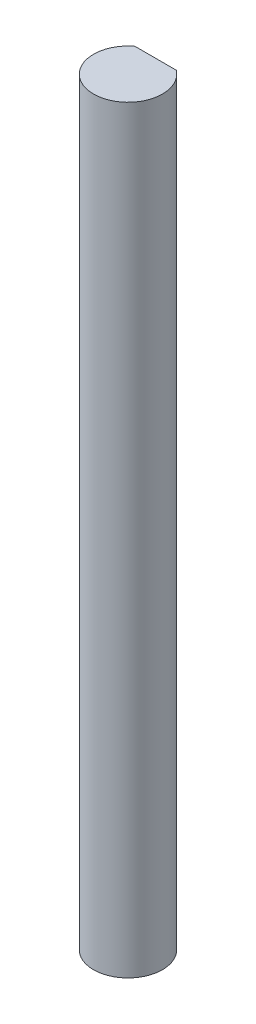
ISO-10303-21;
HEADER;
FILE_DESCRIPTION(('STEP AP214'),'2;1');
FILE_NAME('part.step','',(''),(''),'','','');
FILE_SCHEMA(('AUTOMOTIVE_DESIGN { 1 0 10303 214 1 1 1 1 }'));
ENDSEC;
DATA;
#1=APPLICATION_CONTEXT('core data for automotive mechanical design processes');
#2=APPLICATION_PROTOCOL_DEFINITION('international standard','automotive_design',2000,#1);
#3=PRODUCT_CONTEXT('',#1,'mechanical');
#4=PRODUCT('Part','Part','',(#3));
#5=PRODUCT_RELATED_PRODUCT_CATEGORY('part','',(#4));
#6=PRODUCT_DEFINITION_FORMATION('','',#4);
#7=PRODUCT_DEFINITION_CONTEXT('part definition',#1,'design');
#8=PRODUCT_DEFINITION('design','',#6,#7);
#9=PRODUCT_DEFINITION_SHAPE('','',#8);
#10=(LENGTH_UNIT() NAMED_UNIT(*) SI_UNIT(.MILLI.,.METRE.));
#11=(NAMED_UNIT(*) PLANE_ANGLE_UNIT() SI_UNIT($,.RADIAN.));
#12=(NAMED_UNIT(*) SI_UNIT($,.STERADIAN.) SOLID_ANGLE_UNIT());
#13=UNCERTAINTY_MEASURE_WITH_UNIT(LENGTH_MEASURE(1.E-05),#10,'distance_accuracy_value','');
#14=(GEOMETRIC_REPRESENTATION_CONTEXT(3) GLOBAL_UNCERTAINTY_ASSIGNED_CONTEXT((#13)) GLOBAL_UNIT_ASSIGNED_CONTEXT((#10,
#11,#12)) REPRESENTATION_CONTEXT('',''));
#15=CARTESIAN_POINT('',(0.,0.,0.));
#16=DIRECTION('',(0.,0.,1.));
#17=DIRECTION('',(1.,0.,0.));
#18=AXIS2_PLACEMENT_3D('',#15,#16,#17);
#19=CARTESIAN_POINT('',(0.,69.85,0.));
#20=DIRECTION('',(0.,-1.,0.));
#21=DIRECTION('',(0.,0.,-1.));
#22=AXIS2_PLACEMENT_3D('',#19,#20,#21);
#23=CYLINDRICAL_SURFACE('',#22,3.175);
#24=CARTESIAN_POINT('',(0.,0.,0.));
#25=DIRECTION('',(0.,1.,0.));
#26=DIRECTION('',(0.,0.,1.));
#27=AXIS2_PLACEMENT_3D('',#24,#25,#26);
#28=CIRCLE('',#27,3.175);
#29=CARTESIAN_POINT('',(-1.905,0.,-2.54));
#30=VERTEX_POINT('',#29);
#31=CARTESIAN_POINT('',(1.905,0.,-2.54));
#32=VERTEX_POINT('',#31);
#33=EDGE_CURVE('E64',#30,#32,#28,.T.);
#34=ORIENTED_EDGE('',*,*,#33,.T.);
#35=DIRECTION('',(0.,-1.,0.));
#36=VECTOR('',#35,1.);
#37=CARTESIAN_POINT('',(1.905,69.85,-2.54));
#38=LINE('',#37,#36);
#39=CARTESIAN_POINT('',(1.905,69.85,-2.54));
#40=VERTEX_POINT('',#39);
#41=EDGE_CURVE('E11',#40,#32,#38,.T.);
#42=ORIENTED_EDGE('',*,*,#41,.F.);
#43=CARTESIAN_POINT('',(0.,69.85,0.));
#44=DIRECTION('',(0.,1.,0.));
#45=DIRECTION('',(0.,0.,1.));
#46=AXIS2_PLACEMENT_3D('',#43,#44,#45);
#47=CIRCLE('',#46,3.175);
#48=CARTESIAN_POINT('',(-1.905,69.85,-2.54));
#49=VERTEX_POINT('',#48);
#50=EDGE_CURVE('E63',#49,#40,#47,.T.);
#51=ORIENTED_EDGE('',*,*,#50,.F.);
#52=DIRECTION('',(0.,-1.,0.));
#53=VECTOR('',#52,1.);
#54=CARTESIAN_POINT('',(-1.905,69.85,-2.54));
#55=LINE('',#54,#53);
#56=EDGE_CURVE('E41',#49,#30,#55,.T.);
#57=ORIENTED_EDGE('',*,*,#56,.T.);
#58=EDGE_LOOP('',(#34,#42,#51,#57));
#59=FACE_BOUND('',#58,.T.);
#60=ADVANCED_FACE('F33',(#59),#23,.T.);
#61=CARTESIAN_POINT('',(-1.905,69.85,-2.54));
#62=DIRECTION('',(0.,0.,1.));
#63=DIRECTION('',(1.,0.,0.));
#64=AXIS2_PLACEMENT_3D('',#61,#62,#63);
#65=PLANE('',#64);
#66=DIRECTION('',(-1.,0.,0.));
#67=VECTOR('',#66,1.);
#68=CARTESIAN_POINT('',(-1.905,0.,-2.54));
#69=LINE('',#68,#67);
#70=EDGE_CURVE('E56',#32,#30,#69,.T.);
#71=ORIENTED_EDGE('',*,*,#70,.T.);
#72=ORIENTED_EDGE('',*,*,#56,.F.);
#73=DIRECTION('',(-1.,0.,0.));
#74=VECTOR('',#73,1.);
#75=CARTESIAN_POINT('',(-1.905,69.85,-2.54));
#76=LINE('',#75,#74);
#77=EDGE_CURVE('E48',#40,#49,#76,.T.);
#78=ORIENTED_EDGE('',*,*,#77,.F.);
#79=ORIENTED_EDGE('',*,*,#41,.T.);
#80=EDGE_LOOP('',(#71,#72,#78,#79));
#81=FACE_BOUND('',#80,.T.);
#82=ADVANCED_FACE('F59',(#81),#65,.F.);
#83=CARTESIAN_POINT('',(0.,69.85,0.));
#84=DIRECTION('',(0.,1.,0.));
#85=DIRECTION('',(0.,0.,1.));
#86=AXIS2_PLACEMENT_3D('',#83,#84,#85);
#87=PLANE('',#86);
#88=ORIENTED_EDGE('',*,*,#50,.T.);
#89=ORIENTED_EDGE('',*,*,#77,.T.);
#90=EDGE_LOOP('',(#88,#89));
#91=FACE_BOUND('',#90,.T.);
#92=ADVANCED_FACE('F71',(#91),#87,.T.);
#93=CARTESIAN_POINT('',(0.,0.,0.));
#94=DIRECTION('',(0.,1.,0.));
#95=DIRECTION('',(0.,0.,1.));
#96=AXIS2_PLACEMENT_3D('',#93,#94,#95);
#97=PLANE('',#96);
#98=ORIENTED_EDGE('',*,*,#33,.F.);
#99=ORIENTED_EDGE('',*,*,#70,.F.);
#100=EDGE_LOOP('',(#98,#99));
#101=FACE_BOUND('',#100,.T.);
#102=ADVANCED_FACE('F67',(#101),#97,.F.);
#103=CLOSED_SHELL('',(#60,#82,#92,#102));
#104=MANIFOLD_SOLID_BREP('B2',#103);
#105=ADVANCED_BREP_SHAPE_REPRESENTATION('',(#18,#104),#14);
#106=SHAPE_DEFINITION_REPRESENTATION(#9,#105);
ENDSEC;
END-ISO-10303-21;
